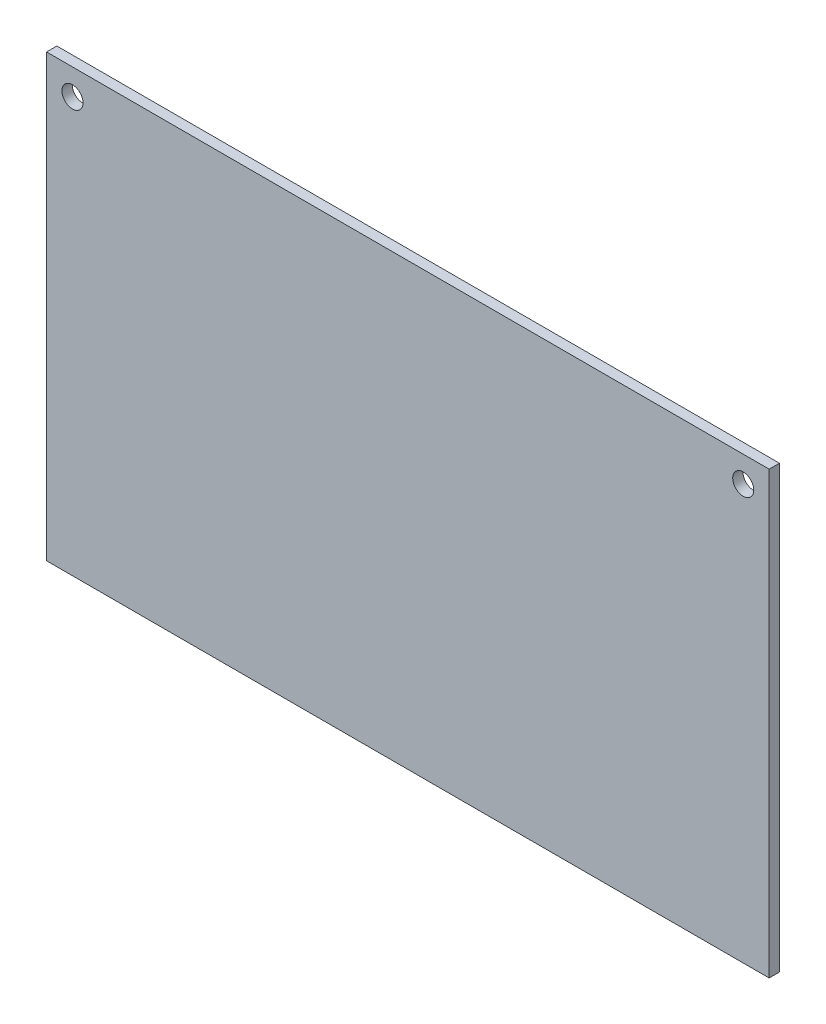
ISO-10303-21;
HEADER;
FILE_DESCRIPTION(('STEP AP214'),'2;1');
FILE_NAME('part.step','',(''),(''),'','','');
FILE_SCHEMA(('AUTOMOTIVE_DESIGN { 1 0 10303 214 1 1 1 1 }'));
ENDSEC;
DATA;
#1=APPLICATION_CONTEXT('core data for automotive mechanical design processes');
#2=APPLICATION_PROTOCOL_DEFINITION('international standard','automotive_design',2000,#1);
#3=PRODUCT_CONTEXT('',#1,'mechanical');
#4=PRODUCT('Part','Part','',(#3));
#5=PRODUCT_RELATED_PRODUCT_CATEGORY('part','',(#4));
#6=PRODUCT_DEFINITION_FORMATION('','',#4);
#7=PRODUCT_DEFINITION_CONTEXT('part definition',#1,'design');
#8=PRODUCT_DEFINITION('design','',#6,#7);
#9=PRODUCT_DEFINITION_SHAPE('','',#8);
#10=(LENGTH_UNIT() NAMED_UNIT(*) SI_UNIT(.MILLI.,.METRE.));
#11=(NAMED_UNIT(*) PLANE_ANGLE_UNIT() SI_UNIT($,.RADIAN.));
#12=(NAMED_UNIT(*) SI_UNIT($,.STERADIAN.) SOLID_ANGLE_UNIT());
#13=UNCERTAINTY_MEASURE_WITH_UNIT(LENGTH_MEASURE(1.E-05),#10,'distance_accuracy_value','');
#14=(GEOMETRIC_REPRESENTATION_CONTEXT(3) GLOBAL_UNCERTAINTY_ASSIGNED_CONTEXT((#13)) GLOBAL_UNIT_ASSIGNED_CONTEXT((#10,
#11,#12)) REPRESENTATION_CONTEXT('',''));
#15=CARTESIAN_POINT('',(0.,0.,0.));
#16=DIRECTION('',(0.,0.,1.));
#17=DIRECTION('',(1.,0.,0.));
#18=AXIS2_PLACEMENT_3D('',#15,#16,#17);
#19=CARTESIAN_POINT('',(0.,68.,1.5875));
#20=DIRECTION('',(0.,0.,-1.));
#21=DIRECTION('',(-1.,0.,0.));
#22=AXIS2_PLACEMENT_3D('',#19,#20,#21);
#23=PLANE('',#22);
#24=CARTESIAN_POINT('',(4.,64.,1.5875));
#25=DIRECTION('',(0.,0.,1.));
#26=DIRECTION('',(1.,0.,0.));
#27=AXIS2_PLACEMENT_3D('',#24,#25,#26);
#28=CIRCLE('',#27,1.6256);
#29=CARTESIAN_POINT('',(5.6256,64.,1.5875));
#30=VERTEX_POINT('',#29);
#31=EDGE_CURVE('E99',#30,#30,#28,.T.);
#32=ORIENTED_EDGE('',*,*,#31,.F.);
#33=EDGE_LOOP('',(#32));
#34=FACE_BOUND('',#33,.T.);
#35=DIRECTION('',(0.,-1.,0.));
#36=VECTOR('',#35,1.);
#37=CARTESIAN_POINT('',(0.,0.,1.5875));
#38=LINE('',#37,#36);
#39=CARTESIAN_POINT('',(0.,68.,1.5875));
#40=VERTEX_POINT('',#39);
#41=CARTESIAN_POINT('',(0.,0.,1.5875));
#42=VERTEX_POINT('',#41);
#43=EDGE_CURVE('E84',#40,#42,#38,.T.);
#44=ORIENTED_EDGE('',*,*,#43,.T.);
#45=DIRECTION('',(1.,0.,0.));
#46=VECTOR('',#45,1.);
#47=CARTESIAN_POINT('',(0.,0.,1.5875));
#48=LINE('',#47,#46);
#49=CARTESIAN_POINT('',(111.5,0.,1.5875));
#50=VERTEX_POINT('',#49);
#51=EDGE_CURVE('E79',#42,#50,#48,.T.);
#52=ORIENTED_EDGE('',*,*,#51,.T.);
#53=DIRECTION('',(0.,1.,0.));
#54=VECTOR('',#53,1.);
#55=CARTESIAN_POINT('',(111.5,0.,1.5875));
#56=LINE('',#55,#54);
#57=CARTESIAN_POINT('',(111.5,68.,1.5875));
#58=VERTEX_POINT('',#57);
#59=EDGE_CURVE('E82',#50,#58,#56,.T.);
#60=ORIENTED_EDGE('',*,*,#59,.T.);
#61=DIRECTION('',(-1.,0.,0.));
#62=VECTOR('',#61,1.);
#63=CARTESIAN_POINT('',(0.,68.,1.5875));
#64=LINE('',#63,#62);
#65=EDGE_CURVE('E49',#58,#40,#64,.T.);
#66=ORIENTED_EDGE('',*,*,#65,.T.);
#67=EDGE_LOOP('',(#44,#52,#60,#66));
#68=FACE_BOUND('',#67,.T.);
#69=CARTESIAN_POINT('',(107.5,64.,1.5875));
#70=DIRECTION('',(0.,0.,1.));
#71=DIRECTION('',(1.,0.,0.));
#72=AXIS2_PLACEMENT_3D('',#69,#70,#71);
#73=CIRCLE('',#72,1.6256);
#74=CARTESIAN_POINT('',(109.1256,64.,1.5875));
#75=VERTEX_POINT('',#74);
#76=EDGE_CURVE('E114',#75,#75,#73,.T.);
#77=ORIENTED_EDGE('',*,*,#76,.F.);
#78=EDGE_LOOP('',(#77));
#79=FACE_BOUND('',#78,.T.);
#80=ADVANCED_FACE('F32',(#34,#68,#79),#23,.F.);
#81=CARTESIAN_POINT('',(0.,68.,0.));
#82=DIRECTION('',(0.,0.,-1.));
#83=DIRECTION('',(-1.,0.,0.));
#84=AXIS2_PLACEMENT_3D('',#81,#82,#83);
#85=PLANE('',#84);
#86=CARTESIAN_POINT('',(4.,64.,0.));
#87=DIRECTION('',(0.,0.,1.));
#88=DIRECTION('',(1.,0.,0.));
#89=AXIS2_PLACEMENT_3D('',#86,#87,#88);
#90=CIRCLE('',#89,1.6256);
#91=CARTESIAN_POINT('',(5.6256,64.,0.));
#92=VERTEX_POINT('',#91);
#93=EDGE_CURVE('E111',#92,#92,#90,.T.);
#94=ORIENTED_EDGE('',*,*,#93,.T.);
#95=EDGE_LOOP('',(#94));
#96=FACE_BOUND('',#95,.T.);
#97=DIRECTION('',(0.,-1.,0.));
#98=VECTOR('',#97,1.);
#99=CARTESIAN_POINT('',(0.,0.,0.));
#100=LINE('',#99,#98);
#101=CARTESIAN_POINT('',(0.,68.,0.));
#102=VERTEX_POINT('',#101);
#103=CARTESIAN_POINT('',(0.,0.,0.));
#104=VERTEX_POINT('',#103);
#105=EDGE_CURVE('E96',#102,#104,#100,.T.);
#106=ORIENTED_EDGE('',*,*,#105,.F.);
#107=DIRECTION('',(-1.,0.,0.));
#108=VECTOR('',#107,1.);
#109=CARTESIAN_POINT('',(0.,68.,0.));
#110=LINE('',#109,#108);
#111=CARTESIAN_POINT('',(111.5,68.,0.));
#112=VERTEX_POINT('',#111);
#113=EDGE_CURVE('E72',#112,#102,#110,.T.);
#114=ORIENTED_EDGE('',*,*,#113,.F.);
#115=DIRECTION('',(0.,1.,0.));
#116=VECTOR('',#115,1.);
#117=CARTESIAN_POINT('',(111.5,0.,0.));
#118=LINE('',#117,#116);
#119=CARTESIAN_POINT('',(111.5,0.,0.));
#120=VERTEX_POINT('',#119);
#121=EDGE_CURVE('E66',#120,#112,#118,.T.);
#122=ORIENTED_EDGE('',*,*,#121,.F.);
#123=DIRECTION('',(1.,0.,0.));
#124=VECTOR('',#123,1.);
#125=CARTESIAN_POINT('',(0.,0.,0.));
#126=LINE('',#125,#124);
#127=EDGE_CURVE('E88',#104,#120,#126,.T.);
#128=ORIENTED_EDGE('',*,*,#127,.F.);
#129=EDGE_LOOP('',(#106,#114,#122,#128));
#130=FACE_BOUND('',#129,.T.);
#131=CARTESIAN_POINT('',(107.5,64.,0.));
#132=DIRECTION('',(0.,0.,1.));
#133=DIRECTION('',(1.,0.,0.));
#134=AXIS2_PLACEMENT_3D('',#131,#132,#133);
#135=CIRCLE('',#134,1.6256);
#136=CARTESIAN_POINT('',(109.1256,64.,0.));
#137=VERTEX_POINT('',#136);
#138=EDGE_CURVE('E117',#137,#137,#135,.T.);
#139=ORIENTED_EDGE('',*,*,#138,.T.);
#140=EDGE_LOOP('',(#139));
#141=FACE_BOUND('',#140,.T.);
#142=ADVANCED_FACE('F107',(#96,#130,#141),#85,.T.);
#143=CARTESIAN_POINT('',(0.,0.,1.5875));
#144=DIRECTION('',(1.,0.,0.));
#145=DIRECTION('',(0.,0.,-1.));
#146=AXIS2_PLACEMENT_3D('',#143,#144,#145);
#147=PLANE('',#146);
#148=ORIENTED_EDGE('',*,*,#105,.T.);
#149=DIRECTION('',(0.,0.,-1.));
#150=VECTOR('',#149,1.);
#151=CARTESIAN_POINT('',(0.,0.,1.5875));
#152=LINE('',#151,#150);
#153=EDGE_CURVE('E11',#42,#104,#152,.T.);
#154=ORIENTED_EDGE('',*,*,#153,.F.);
#155=ORIENTED_EDGE('',*,*,#43,.F.);
#156=DIRECTION('',(0.,0.,-1.));
#157=VECTOR('',#156,1.);
#158=CARTESIAN_POINT('',(0.,68.,1.5875));
#159=LINE('',#158,#157);
#160=EDGE_CURVE('E92',#40,#102,#159,.T.);
#161=ORIENTED_EDGE('',*,*,#160,.T.);
#162=EDGE_LOOP('',(#148,#154,#155,#161));
#163=FACE_BOUND('',#162,.T.);
#164=ADVANCED_FACE('F34',(#163),#147,.F.);
#165=CARTESIAN_POINT('',(0.,0.,1.5875));
#166=DIRECTION('',(0.,1.,0.));
#167=DIRECTION('',(0.,0.,1.));
#168=AXIS2_PLACEMENT_3D('',#165,#166,#167);
#169=PLANE('',#168);
#170=ORIENTED_EDGE('',*,*,#127,.T.);
#171=DIRECTION('',(0.,0.,-1.));
#172=VECTOR('',#171,1.);
#173=CARTESIAN_POINT('',(111.5,0.,1.5875));
#174=LINE('',#173,#172);
#175=EDGE_CURVE('E41',#50,#120,#174,.T.);
#176=ORIENTED_EDGE('',*,*,#175,.F.);
#177=ORIENTED_EDGE('',*,*,#51,.F.);
#178=ORIENTED_EDGE('',*,*,#153,.T.);
#179=EDGE_LOOP('',(#170,#176,#177,#178));
#180=FACE_BOUND('',#179,.T.);
#181=ADVANCED_FACE('F87',(#180),#169,.F.);
#182=CARTESIAN_POINT('',(111.5,0.,1.5875));
#183=DIRECTION('',(-1.,0.,0.));
#184=DIRECTION('',(0.,0.,1.));
#185=AXIS2_PLACEMENT_3D('',#182,#183,#184);
#186=PLANE('',#185);
#187=ORIENTED_EDGE('',*,*,#121,.T.);
#188=DIRECTION('',(0.,0.,-1.));
#189=VECTOR('',#188,1.);
#190=CARTESIAN_POINT('',(111.5,68.,1.5875));
#191=LINE('',#190,#189);
#192=EDGE_CURVE('E89',#58,#112,#191,.T.);
#193=ORIENTED_EDGE('',*,*,#192,.F.);
#194=ORIENTED_EDGE('',*,*,#59,.F.);
#195=ORIENTED_EDGE('',*,*,#175,.T.);
#196=EDGE_LOOP('',(#187,#193,#194,#195));
#197=FACE_BOUND('',#196,.T.);
#198=ADVANCED_FACE('F90',(#197),#186,.F.);
#199=CARTESIAN_POINT('',(0.,68.,1.5875));
#200=DIRECTION('',(0.,-1.,0.));
#201=DIRECTION('',(0.,0.,-1.));
#202=AXIS2_PLACEMENT_3D('',#199,#200,#201);
#203=PLANE('',#202);
#204=ORIENTED_EDGE('',*,*,#113,.T.);
#205=ORIENTED_EDGE('',*,*,#160,.F.);
#206=ORIENTED_EDGE('',*,*,#65,.F.);
#207=ORIENTED_EDGE('',*,*,#192,.T.);
#208=EDGE_LOOP('',(#204,#205,#206,#207));
#209=FACE_BOUND('',#208,.T.);
#210=ADVANCED_FACE('F104',(#209),#203,.F.);
#211=CARTESIAN_POINT('',(4.,64.,1.5875));
#212=DIRECTION('',(0.,0.,-1.));
#213=DIRECTION('',(-1.,0.,0.));
#214=AXIS2_PLACEMENT_3D('',#211,#212,#213);
#215=CYLINDRICAL_SURFACE('',#214,1.6256);
#216=ORIENTED_EDGE('',*,*,#31,.T.);
#217=EDGE_LOOP('',(#216));
#218=FACE_BOUND('',#217,.T.);
#219=ORIENTED_EDGE('',*,*,#93,.F.);
#220=EDGE_LOOP('',(#219));
#221=FACE_BOUND('',#220,.T.);
#222=ADVANCED_FACE('F135',(#218,#221),#215,.F.);
#223=CARTESIAN_POINT('',(107.5,64.,1.5875));
#224=DIRECTION('',(0.,0.,-1.));
#225=DIRECTION('',(-1.,0.,0.));
#226=AXIS2_PLACEMENT_3D('',#223,#224,#225);
#227=CYLINDRICAL_SURFACE('',#226,1.6256);
#228=ORIENTED_EDGE('',*,*,#76,.T.);
#229=EDGE_LOOP('',(#228));
#230=FACE_BOUND('',#229,.T.);
#231=ORIENTED_EDGE('',*,*,#138,.F.);
#232=EDGE_LOOP('',(#231));
#233=FACE_BOUND('',#232,.T.);
#234=ADVANCED_FACE('F123',(#230,#233),#227,.F.);
#235=CLOSED_SHELL('',(#80,#142,#164,#181,#198,#210,#222,#234));
#236=MANIFOLD_SOLID_BREP('B2',#235);
#237=ADVANCED_BREP_SHAPE_REPRESENTATION('',(#18,#236),#14);
#238=SHAPE_DEFINITION_REPRESENTATION(#9,#237);
ENDSEC;
END-ISO-10303-21;
